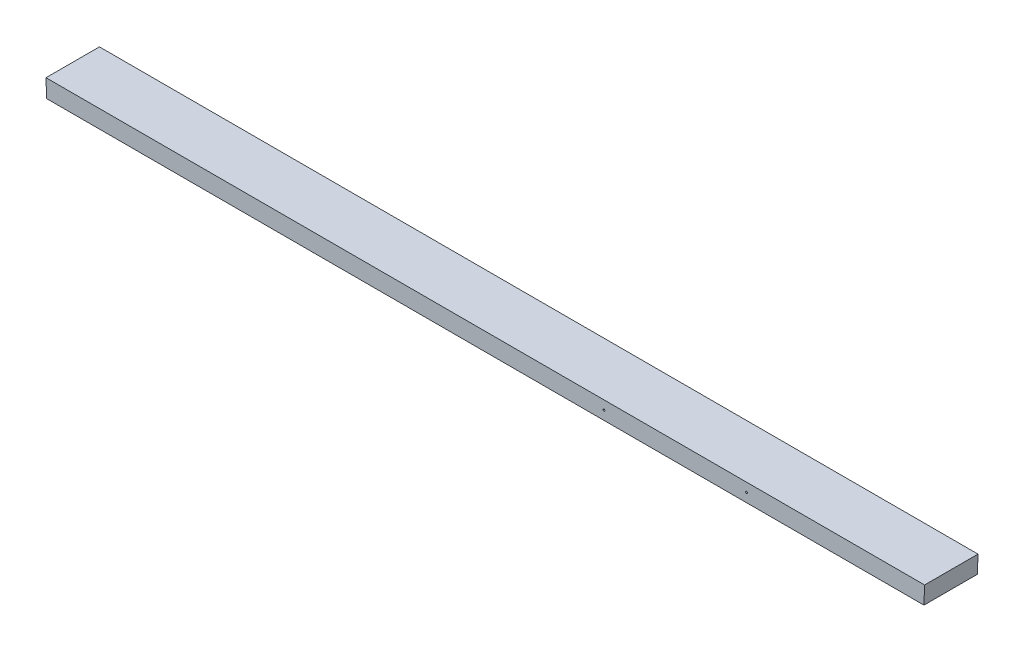
ISO-10303-21;
HEADER;
FILE_DESCRIPTION(('STEP AP214'),'2;1');
FILE_NAME('part.step','',(''),(''),'','','');
FILE_SCHEMA(('AUTOMOTIVE_DESIGN { 1 0 10303 214 1 1 1 1 }'));
ENDSEC;
DATA;
#1=APPLICATION_CONTEXT('core data for automotive mechanical design processes');
#2=APPLICATION_PROTOCOL_DEFINITION('international standard','automotive_design',2000,#1);
#3=PRODUCT_CONTEXT('',#1,'mechanical');
#4=PRODUCT('Part','Part','',(#3));
#5=PRODUCT_RELATED_PRODUCT_CATEGORY('part','',(#4));
#6=PRODUCT_DEFINITION_FORMATION('','',#4);
#7=PRODUCT_DEFINITION_CONTEXT('part definition',#1,'design');
#8=PRODUCT_DEFINITION('design','',#6,#7);
#9=PRODUCT_DEFINITION_SHAPE('','',#8);
#10=(LENGTH_UNIT() NAMED_UNIT(*) SI_UNIT(.MILLI.,.METRE.));
#11=(NAMED_UNIT(*) PLANE_ANGLE_UNIT() SI_UNIT($,.RADIAN.));
#12=(NAMED_UNIT(*) SI_UNIT($,.STERADIAN.) SOLID_ANGLE_UNIT());
#13=UNCERTAINTY_MEASURE_WITH_UNIT(LENGTH_MEASURE(1.E-05),#10,'distance_accuracy_value','');
#14=(GEOMETRIC_REPRESENTATION_CONTEXT(3) GLOBAL_UNCERTAINTY_ASSIGNED_CONTEXT((#13)) GLOBAL_UNIT_ASSIGNED_CONTEXT((#10,
#11,#12)) REPRESENTATION_CONTEXT('',''));
#15=CARTESIAN_POINT('',(0.,0.,0.));
#16=DIRECTION('',(0.,0.,1.));
#17=DIRECTION('',(1.,0.,0.));
#18=AXIS2_PLACEMENT_3D('',#15,#16,#17);
#19=CARTESIAN_POINT('',(-469.231738923998,5916.9300001442,2683.51));
#20=DIRECTION('',(0.,-1.,0.));
#21=DIRECTION('',(0.,0.,-1.));
#22=AXIS2_PLACEMENT_3D('',#19,#20,#21);
#23=PLANE('',#22);
#24=DIRECTION('',(1.,0.,0.));
#25=VECTOR('',#24,1.);
#26=CARTESIAN_POINT('',(-5.68434188608079E-13,5916.9300001442,2683.51));
#27=LINE('',#26,#25);
#28=CARTESIAN_POINT('',(-469.231738923998,5916.9300001442,2683.51));
#29=VERTEX_POINT('',#28);
#30=CARTESIAN_POINT('',(469.231738923998,5916.9300001442,2683.51));
#31=VERTEX_POINT('',#30);
#32=EDGE_CURVE('E156',#29,#31,#27,.T.);
#33=ORIENTED_EDGE('',*,*,#32,.T.);
#34=DIRECTION('',(0.,0.,1.));
#35=VECTOR('',#34,1.);
#36=CARTESIAN_POINT('',(469.231738923998,5916.9300001442,2683.51));
#37=LINE('',#36,#35);
#38=CARTESIAN_POINT('',(469.231738923998,5916.9300001442,2740.66));
#39=VERTEX_POINT('',#38);
#40=EDGE_CURVE('E78',#39,#31,#37,.F.);
#41=ORIENTED_EDGE('',*,*,#40,.F.);
#42=DIRECTION('',(-1.,0.,0.));
#43=VECTOR('',#42,1.);
#44=CARTESIAN_POINT('',(-5.68434188608079E-13,5916.9300001442,2740.66));
#45=LINE('',#44,#43);
#46=CARTESIAN_POINT('',(-469.231738923998,5916.9300001442,2740.66));
#47=VERTEX_POINT('',#46);
#48=EDGE_CURVE('E83',#39,#47,#45,.T.);
#49=ORIENTED_EDGE('',*,*,#48,.T.);
#50=DIRECTION('',(0.,0.,1.));
#51=VECTOR('',#50,1.);
#52=CARTESIAN_POINT('',(-469.231738923998,5916.9300001442,2683.51));
#53=LINE('',#52,#51);
#54=EDGE_CURVE('E149',#29,#47,#53,.T.);
#55=ORIENTED_EDGE('',*,*,#54,.F.);
#56=EDGE_LOOP('',(#33,#41,#49,#55));
#57=FACE_BOUND('',#56,.T.);
#58=ADVANCED_FACE('F37',(#57),#23,.T.);
#59=CARTESIAN_POINT('',(-5.68434188608079E-13,5926.4550001442,2740.66));
#60=DIRECTION('',(0.,0.,-1.));
#61=DIRECTION('',(-1.,0.,0.));
#62=AXIS2_PLACEMENT_3D('',#59,#60,#61);
#63=PLANE('',#62);
#64=CARTESIAN_POINT('',(127.000000000001,5926.4550001442,2740.66));
#65=DIRECTION('',(0.,0.,-1.));
#66=DIRECTION('',(-1.,0.,0.));
#67=AXIS2_PLACEMENT_3D('',#64,#65,#66);
#68=CIRCLE('',#67,0.991870000000006);
#69=CARTESIAN_POINT('',(126.008130000001,5926.4550001442,2740.66));
#70=VERTEX_POINT('',#69);
#71=EDGE_CURVE('E40',#70,#70,#68,.T.);
#72=ORIENTED_EDGE('',*,*,#71,.T.);
#73=EDGE_LOOP('',(#72));
#74=FACE_BOUND('',#73,.T.);
#75=CARTESIAN_POINT('',(279.400000000001,5926.4550001442,2740.66));
#76=DIRECTION('',(0.,0.,-1.));
#77=DIRECTION('',(-1.,0.,0.));
#78=AXIS2_PLACEMENT_3D('',#75,#76,#77);
#79=CIRCLE('',#78,0.991870000000006);
#80=CARTESIAN_POINT('',(278.408130000001,5926.4550001442,2740.66));
#81=VERTEX_POINT('',#80);
#82=EDGE_CURVE('E120',#81,#81,#79,.T.);
#83=ORIENTED_EDGE('',*,*,#82,.T.);
#84=EDGE_LOOP('',(#83));
#85=FACE_BOUND('',#84,.T.);
#86=ORIENTED_EDGE('',*,*,#48,.F.);
#87=DIRECTION('',(0.0340355254361646,0.999420623665674,0.));
#88=VECTOR('',#87,1.);
#89=CARTESIAN_POINT('',(469.231738923998,5916.9300001442,2740.66));
#90=LINE('',#89,#88);
#91=CARTESIAN_POINT('',(469.880491555479,5935.9800001442,2740.66));
#92=VERTEX_POINT('',#91);
#93=EDGE_CURVE('E161',#92,#39,#90,.F.);
#94=ORIENTED_EDGE('',*,*,#93,.F.);
#95=DIRECTION('',(1.,0.,0.));
#96=VECTOR('',#95,1.);
#97=CARTESIAN_POINT('',(469.880491555479,5935.9800001442,2740.66));
#98=LINE('',#97,#96);
#99=CARTESIAN_POINT('',(-469.880491555479,5935.9800001442,2740.66));
#100=VERTEX_POINT('',#99);
#101=EDGE_CURVE('E146',#100,#92,#98,.T.);
#102=ORIENTED_EDGE('',*,*,#101,.F.);
#103=DIRECTION('',(0.0340355254361644,-0.999420623665674,0.));
#104=VECTOR('',#103,1.);
#105=CARTESIAN_POINT('',(-469.880491555479,5935.9800001442,2740.66));
#106=LINE('',#105,#104);
#107=EDGE_CURVE('E153',#47,#100,#106,.F.);
#108=ORIENTED_EDGE('',*,*,#107,.F.);
#109=EDGE_LOOP('',(#86,#94,#102,#108));
#110=FACE_BOUND('',#109,.T.);
#111=ADVANCED_FACE('F176',(#74,#85,#110),#63,.F.);
#112=CARTESIAN_POINT('',(469.231738923998,5916.9300001442,2683.51));
#113=DIRECTION('',(0.999420623665674,-0.0340355254361646,0.));
#114=DIRECTION('',(0.0340355254361646,0.999420623665674,0.));
#115=AXIS2_PLACEMENT_3D('',#112,#113,#114);
#116=PLANE('',#115);
#117=DIRECTION('',(0.0340355254362027,0.999420623665672,0.));
#118=VECTOR('',#117,1.);
#119=CARTESIAN_POINT('',(469.231738923998,5916.9300001442,2683.51));
#120=LINE('',#119,#118);
#121=CARTESIAN_POINT('',(469.880491555478,5935.9800001442,2683.51));
#122=VERTEX_POINT('',#121);
#123=EDGE_CURVE('E158',#31,#122,#120,.T.);
#124=ORIENTED_EDGE('',*,*,#123,.T.);
#125=DIRECTION('',(0.,0.,1.));
#126=VECTOR('',#125,1.);
#127=CARTESIAN_POINT('',(469.880491555479,5935.9800001442,2683.51));
#128=LINE('',#127,#126);
#129=EDGE_CURVE('E143',#92,#122,#128,.F.);
#130=ORIENTED_EDGE('',*,*,#129,.F.);
#131=ORIENTED_EDGE('',*,*,#93,.T.);
#132=ORIENTED_EDGE('',*,*,#40,.T.);
#133=EDGE_LOOP('',(#124,#130,#131,#132));
#134=FACE_BOUND('',#133,.T.);
#135=ADVANCED_FACE('F214',(#134),#116,.T.);
#136=CARTESIAN_POINT('',(-5.68434188608079E-13,5565.14000007211,2683.51));
#137=DIRECTION('',(0.,0.,1.));
#138=DIRECTION('',(1.,0.,0.));
#139=AXIS2_PLACEMENT_3D('',#136,#137,#138);
#140=PLANE('',#139);
#141=CARTESIAN_POINT('',(0.,5926.4550001442,2683.51));
#142=DIRECTION('',(0.,0.,1.));
#143=DIRECTION('',(1.,0.,0.));
#144=AXIS2_PLACEMENT_3D('',#141,#142,#143);
#145=CIRCLE('',#144,0.991870000000001);
#146=CARTESIAN_POINT('',(0.991870000000001,5926.4550001442,2683.51));
#147=VERTEX_POINT('',#146);
#148=EDGE_CURVE('E124',#147,#147,#145,.T.);
#149=ORIENTED_EDGE('',*,*,#148,.T.);
#150=EDGE_LOOP('',(#149));
#151=FACE_BOUND('',#150,.T.);
#152=CARTESIAN_POINT('',(203.200000000001,5926.4550001442,2683.51));
#153=DIRECTION('',(0.,0.,1.));
#154=DIRECTION('',(1.,0.,0.));
#155=AXIS2_PLACEMENT_3D('',#152,#153,#154);
#156=CIRCLE('',#155,0.991870000000006);
#157=CARTESIAN_POINT('',(204.191870000001,5926.4550001442,2683.51));
#158=VERTEX_POINT('',#157);
#159=EDGE_CURVE('E128',#158,#158,#156,.T.);
#160=ORIENTED_EDGE('',*,*,#159,.T.);
#161=EDGE_LOOP('',(#160));
#162=FACE_BOUND('',#161,.T.);
#163=CARTESIAN_POINT('',(406.400000000001,5926.4550001442,2683.51));
#164=DIRECTION('',(0.,0.,1.));
#165=DIRECTION('',(1.,0.,0.));
#166=AXIS2_PLACEMENT_3D('',#163,#164,#165);
#167=CIRCLE('',#166,0.991870000000006);
#168=CARTESIAN_POINT('',(407.391870000001,5926.4550001442,2683.51));
#169=VERTEX_POINT('',#168);
#170=EDGE_CURVE('E132',#169,#169,#167,.T.);
#171=ORIENTED_EDGE('',*,*,#170,.T.);
#172=EDGE_LOOP('',(#171));
#173=FACE_BOUND('',#172,.T.);
#174=CARTESIAN_POINT('',(-406.4,5926.4550001442,2683.51));
#175=DIRECTION('',(0.,0.,1.));
#176=DIRECTION('',(1.,0.,0.));
#177=AXIS2_PLACEMENT_3D('',#174,#175,#176);
#178=CIRCLE('',#177,0.991870000000006);
#179=CARTESIAN_POINT('',(-405.40813,5926.4550001442,2683.51));
#180=VERTEX_POINT('',#179);
#181=EDGE_CURVE('E136',#180,#180,#178,.T.);
#182=ORIENTED_EDGE('',*,*,#181,.T.);
#183=EDGE_LOOP('',(#182));
#184=FACE_BOUND('',#183,.T.);
#185=CARTESIAN_POINT('',(-203.2,5926.4550001442,2683.51));
#186=DIRECTION('',(0.,0.,1.));
#187=DIRECTION('',(1.,0.,0.));
#188=AXIS2_PLACEMENT_3D('',#185,#186,#187);
#189=CIRCLE('',#188,0.991870000000006);
#190=CARTESIAN_POINT('',(-202.20813,5926.4550001442,2683.51));
#191=VERTEX_POINT('',#190);
#192=EDGE_CURVE('E139',#191,#191,#189,.T.);
#193=ORIENTED_EDGE('',*,*,#192,.T.);
#194=EDGE_LOOP('',(#193));
#195=FACE_BOUND('',#194,.T.);
#196=DIRECTION('',(0.0340355254361644,-0.999420623665674,0.));
#197=VECTOR('',#196,1.);
#198=CARTESIAN_POINT('',(-469.880491555479,5935.9800001442,2683.51));
#199=LINE('',#198,#197);
#200=CARTESIAN_POINT('',(-469.880491555479,5935.9800001442,2683.51));
#201=VERTEX_POINT('',#200);
#202=EDGE_CURVE('E55',#201,#29,#199,.T.);
#203=ORIENTED_EDGE('',*,*,#202,.F.);
#204=DIRECTION('',(1.,0.,0.));
#205=VECTOR('',#204,1.);
#206=CARTESIAN_POINT('',(469.880491555479,5935.9800001442,2683.51));
#207=LINE('',#206,#205);
#208=EDGE_CURVE('E46',#122,#201,#207,.F.);
#209=ORIENTED_EDGE('',*,*,#208,.F.);
#210=ORIENTED_EDGE('',*,*,#123,.F.);
#211=ORIENTED_EDGE('',*,*,#32,.F.);
#212=EDGE_LOOP('',(#203,#209,#210,#211));
#213=FACE_BOUND('',#212,.T.);
#214=ADVANCED_FACE('F207',(#151,#162,#173,#184,#195,#213),#140,.F.);
#215=CARTESIAN_POINT('',(-469.880491555479,5935.9800001442,2683.51));
#216=DIRECTION('',(-0.999420623665674,-0.0340355254361644,0.));
#217=DIRECTION('',(0.0340355254361644,-0.999420623665674,0.));
#218=AXIS2_PLACEMENT_3D('',#215,#216,#217);
#219=PLANE('',#218);
#220=ORIENTED_EDGE('',*,*,#202,.T.);
#221=ORIENTED_EDGE('',*,*,#54,.T.);
#222=ORIENTED_EDGE('',*,*,#107,.T.);
#223=DIRECTION('',(0.,0.,1.));
#224=VECTOR('',#223,1.);
#225=CARTESIAN_POINT('',(-469.880491555479,5935.9800001442,2683.51));
#226=LINE('',#225,#224);
#227=EDGE_CURVE('E11',#201,#100,#226,.T.);
#228=ORIENTED_EDGE('',*,*,#227,.F.);
#229=EDGE_LOOP('',(#220,#221,#222,#228));
#230=FACE_BOUND('',#229,.T.);
#231=ADVANCED_FACE('F197',(#230),#219,.T.);
#232=CARTESIAN_POINT('',(469.880491555479,5935.9800001442,2683.51));
#233=DIRECTION('',(0.,1.,0.));
#234=DIRECTION('',(0.,0.,1.));
#235=AXIS2_PLACEMENT_3D('',#232,#233,#234);
#236=PLANE('',#235);
#237=ORIENTED_EDGE('',*,*,#208,.T.);
#238=ORIENTED_EDGE('',*,*,#227,.T.);
#239=ORIENTED_EDGE('',*,*,#101,.T.);
#240=ORIENTED_EDGE('',*,*,#129,.T.);
#241=EDGE_LOOP('',(#237,#238,#239,#240));
#242=FACE_BOUND('',#241,.T.);
#243=ADVANCED_FACE('F194',(#242),#236,.T.);
#244=CARTESIAN_POINT('',(-203.2,5926.4550001442,2664.46));
#245=DIRECTION('',(0.,0.,-1.));
#246=DIRECTION('',(-1.,0.,0.));
#247=AXIS2_PLACEMENT_3D('',#244,#245,#246);
#248=CYLINDRICAL_SURFACE('',#247,0.991870000000006);
#249=CARTESIAN_POINT('',(-203.2,5926.4550001442,2696.21));
#250=DIRECTION('',(0.,0.,-1.));
#251=DIRECTION('',(-1.,0.,0.));
#252=AXIS2_PLACEMENT_3D('',#249,#250,#251);
#253=CIRCLE('',#252,0.991870000000006);
#254=CARTESIAN_POINT('',(-204.19187,5926.4550001442,2696.21));
#255=VERTEX_POINT('',#254);
#256=EDGE_CURVE('E137',#255,#255,#253,.T.);
#257=ORIENTED_EDGE('',*,*,#256,.F.);
#258=EDGE_LOOP('',(#257));
#259=FACE_BOUND('',#258,.T.);
#260=ORIENTED_EDGE('',*,*,#192,.F.);
#261=EDGE_LOOP('',(#260));
#262=FACE_BOUND('',#261,.T.);
#263=ADVANCED_FACE('F196',(#259,#262),#248,.F.);
#264=CARTESIAN_POINT('',(-203.2,5926.4550001442,2696.21));
#265=DIRECTION('',(0.,0.,-1.));
#266=DIRECTION('',(-1.,0.,0.));
#267=AXIS2_PLACEMENT_3D('',#264,#265,#266);
#268=CONICAL_SURFACE('',#267,0.991870000000006,1.02974425867677);
#269=CARTESIAN_POINT('',(-203.2,5926.4550001442,2696.8059756222));
#270=VERTEX_POINT('',#269);
#271=VERTEX_LOOP('',#270);
#272=FACE_BOUND('',#271,.T.);
#273=ORIENTED_EDGE('',*,*,#256,.T.);
#274=EDGE_LOOP('',(#273));
#275=FACE_BOUND('',#274,.T.);
#276=ADVANCED_FACE('F204',(#272,#275),#268,.F.);
#277=CARTESIAN_POINT('',(-406.4,5926.4550001442,2664.46));
#278=DIRECTION('',(0.,0.,-1.));
#279=DIRECTION('',(-1.,0.,0.));
#280=AXIS2_PLACEMENT_3D('',#277,#278,#279);
#281=CYLINDRICAL_SURFACE('',#280,0.991870000000006);
#282=CARTESIAN_POINT('',(-406.4,5926.4550001442,2696.21));
#283=DIRECTION('',(0.,0.,-1.));
#284=DIRECTION('',(-1.,0.,0.));
#285=AXIS2_PLACEMENT_3D('',#282,#283,#284);
#286=CIRCLE('',#285,0.991870000000006);
#287=CARTESIAN_POINT('',(-407.39187,5926.4550001442,2696.21));
#288=VERTEX_POINT('',#287);
#289=EDGE_CURVE('E133',#288,#288,#286,.T.);
#290=ORIENTED_EDGE('',*,*,#289,.F.);
#291=EDGE_LOOP('',(#290));
#292=FACE_BOUND('',#291,.T.);
#293=ORIENTED_EDGE('',*,*,#181,.F.);
#294=EDGE_LOOP('',(#293));
#295=FACE_BOUND('',#294,.T.);
#296=ADVANCED_FACE('F305',(#292,#295),#281,.F.);
#297=CARTESIAN_POINT('',(-406.4,5926.4550001442,2696.21));
#298=DIRECTION('',(0.,0.,-1.));
#299=DIRECTION('',(-1.,0.,0.));
#300=AXIS2_PLACEMENT_3D('',#297,#298,#299);
#301=CONICAL_SURFACE('',#300,0.991870000000006,1.02974425867677);
#302=CARTESIAN_POINT('',(-406.4,5926.4550001442,2696.8059756222));
#303=VERTEX_POINT('',#302);
#304=VERTEX_LOOP('',#303);
#305=FACE_BOUND('',#304,.T.);
#306=ORIENTED_EDGE('',*,*,#289,.T.);
#307=EDGE_LOOP('',(#306));
#308=FACE_BOUND('',#307,.T.);
#309=ADVANCED_FACE('F296',(#305,#308),#301,.F.);
#310=CARTESIAN_POINT('',(406.400000000001,5926.4550001442,2664.46));
#311=DIRECTION('',(0.,0.,-1.));
#312=DIRECTION('',(-1.,0.,0.));
#313=AXIS2_PLACEMENT_3D('',#310,#311,#312);
#314=CYLINDRICAL_SURFACE('',#313,0.991870000000006);
#315=CARTESIAN_POINT('',(406.400000000001,5926.4550001442,2696.21));
#316=DIRECTION('',(0.,0.,-1.));
#317=DIRECTION('',(-1.,0.,0.));
#318=AXIS2_PLACEMENT_3D('',#315,#316,#317);
#319=CIRCLE('',#318,0.991870000000006);
#320=CARTESIAN_POINT('',(405.408130000001,5926.4550001442,2696.21));
#321=VERTEX_POINT('',#320);
#322=EDGE_CURVE('E129',#321,#321,#319,.T.);
#323=ORIENTED_EDGE('',*,*,#322,.F.);
#324=EDGE_LOOP('',(#323));
#325=FACE_BOUND('',#324,.T.);
#326=ORIENTED_EDGE('',*,*,#170,.F.);
#327=EDGE_LOOP('',(#326));
#328=FACE_BOUND('',#327,.T.);
#329=ADVANCED_FACE('F287',(#325,#328),#314,.F.);
#330=CARTESIAN_POINT('',(406.400000000001,5926.4550001442,2696.21));
#331=DIRECTION('',(0.,0.,-1.));
#332=DIRECTION('',(-1.,0.,0.));
#333=AXIS2_PLACEMENT_3D('',#330,#331,#332);
#334=CONICAL_SURFACE('',#333,0.991870000000006,1.02974425867677);
#335=CARTESIAN_POINT('',(406.400000000001,5926.4550001442,2696.8059756222));
#336=VERTEX_POINT('',#335);
#337=VERTEX_LOOP('',#336);
#338=FACE_BOUND('',#337,.T.);
#339=ORIENTED_EDGE('',*,*,#322,.T.);
#340=EDGE_LOOP('',(#339));
#341=FACE_BOUND('',#340,.T.);
#342=ADVANCED_FACE('F278',(#338,#341),#334,.F.);
#343=CARTESIAN_POINT('',(203.200000000001,5926.4550001442,2664.46));
#344=DIRECTION('',(0.,0.,-1.));
#345=DIRECTION('',(-1.,0.,0.));
#346=AXIS2_PLACEMENT_3D('',#343,#344,#345);
#347=CYLINDRICAL_SURFACE('',#346,0.991870000000006);
#348=CARTESIAN_POINT('',(203.200000000001,5926.4550001442,2696.21));
#349=DIRECTION('',(0.,0.,-1.));
#350=DIRECTION('',(-1.,0.,0.));
#351=AXIS2_PLACEMENT_3D('',#348,#349,#350);
#352=CIRCLE('',#351,0.991870000000006);
#353=CARTESIAN_POINT('',(202.208130000001,5926.4550001442,2696.21));
#354=VERTEX_POINT('',#353);
#355=EDGE_CURVE('E125',#354,#354,#352,.T.);
#356=ORIENTED_EDGE('',*,*,#355,.F.);
#357=EDGE_LOOP('',(#356));
#358=FACE_BOUND('',#357,.T.);
#359=ORIENTED_EDGE('',*,*,#159,.F.);
#360=EDGE_LOOP('',(#359));
#361=FACE_BOUND('',#360,.T.);
#362=ADVANCED_FACE('F269',(#358,#361),#347,.F.);
#363=CARTESIAN_POINT('',(203.200000000001,5926.4550001442,2696.21));
#364=DIRECTION('',(0.,0.,-1.));
#365=DIRECTION('',(-1.,0.,0.));
#366=AXIS2_PLACEMENT_3D('',#363,#364,#365);
#367=CONICAL_SURFACE('',#366,0.991870000000006,1.02974425867677);
#368=CARTESIAN_POINT('',(203.200000000001,5926.4550001442,2696.8059756222));
#369=VERTEX_POINT('',#368);
#370=VERTEX_LOOP('',#369);
#371=FACE_BOUND('',#370,.T.);
#372=ORIENTED_EDGE('',*,*,#355,.T.);
#373=EDGE_LOOP('',(#372));
#374=FACE_BOUND('',#373,.T.);
#375=ADVANCED_FACE('F260',(#371,#374),#367,.F.);
#376=CARTESIAN_POINT('',(0.,5926.4550001442,2664.46));
#377=DIRECTION('',(0.,0.,-1.));
#378=DIRECTION('',(-1.,0.,0.));
#379=AXIS2_PLACEMENT_3D('',#376,#377,#378);
#380=CYLINDRICAL_SURFACE('',#379,0.991870000000001);
#381=CARTESIAN_POINT('',(0.,5926.4550001442,2696.21));
#382=DIRECTION('',(0.,0.,-1.));
#383=DIRECTION('',(-1.,0.,0.));
#384=AXIS2_PLACEMENT_3D('',#381,#382,#383);
#385=CIRCLE('',#384,0.99187);
#386=CARTESIAN_POINT('',(-0.99187,5926.4550001442,2696.21));
#387=VERTEX_POINT('',#386);
#388=EDGE_CURVE('E121',#387,#387,#385,.T.);
#389=ORIENTED_EDGE('',*,*,#388,.F.);
#390=EDGE_LOOP('',(#389));
#391=FACE_BOUND('',#390,.T.);
#392=ORIENTED_EDGE('',*,*,#148,.F.);
#393=EDGE_LOOP('',(#392));
#394=FACE_BOUND('',#393,.T.);
#395=ADVANCED_FACE('F190',(#391,#394),#380,.F.);
#396=CARTESIAN_POINT('',(0.,5926.4550001442,2696.21));
#397=DIRECTION('',(0.,0.,-1.));
#398=DIRECTION('',(-1.,0.,0.));
#399=AXIS2_PLACEMENT_3D('',#396,#397,#398);
#400=CONICAL_SURFACE('',#399,0.99187,1.02974425867677);
#401=CARTESIAN_POINT('',(0.,5926.4550001442,2696.8059756222));
#402=VERTEX_POINT('',#401);
#403=VERTEX_LOOP('',#402);
#404=FACE_BOUND('',#403,.T.);
#405=ORIENTED_EDGE('',*,*,#388,.T.);
#406=EDGE_LOOP('',(#405));
#407=FACE_BOUND('',#406,.T.);
#408=ADVANCED_FACE('F181',(#404,#407),#400,.F.);
#409=CARTESIAN_POINT('',(279.400000000001,5926.4550001442,2759.71000000001));
#410=DIRECTION('',(0.,0.,1.));
#411=DIRECTION('',(1.,0.,0.));
#412=AXIS2_PLACEMENT_3D('',#409,#410,#411);
#413=CYLINDRICAL_SURFACE('',#412,0.991870000000006);
#414=CARTESIAN_POINT('',(279.400000000001,5926.4550001442,2721.61000000001));
#415=DIRECTION('',(0.,0.,1.));
#416=DIRECTION('',(1.,0.,0.));
#417=AXIS2_PLACEMENT_3D('',#414,#415,#416);
#418=CIRCLE('',#417,0.991870000000006);
#419=CARTESIAN_POINT('',(280.391870000001,5926.4550001442,2721.61000000001));
#420=VERTEX_POINT('',#419);
#421=EDGE_CURVE('E116',#420,#420,#418,.T.);
#422=ORIENTED_EDGE('',*,*,#421,.F.);
#423=EDGE_LOOP('',(#422));
#424=FACE_BOUND('',#423,.T.);
#425=ORIENTED_EDGE('',*,*,#82,.F.);
#426=EDGE_LOOP('',(#425));
#427=FACE_BOUND('',#426,.T.);
#428=ADVANCED_FACE('F178',(#424,#427),#413,.F.);
#429=CARTESIAN_POINT('',(279.400000000001,5926.4550001442,2721.61000000001));
#430=DIRECTION('',(0.,0.,1.));
#431=DIRECTION('',(1.,0.,0.));
#432=AXIS2_PLACEMENT_3D('',#429,#430,#431);
#433=CONICAL_SURFACE('',#432,0.991870000000006,1.02974425867677);
#434=CARTESIAN_POINT('',(279.400000000001,5926.4550001442,2721.01402437781));
#435=VERTEX_POINT('',#434);
#436=VERTEX_LOOP('',#435);
#437=FACE_BOUND('',#436,.T.);
#438=ORIENTED_EDGE('',*,*,#421,.T.);
#439=EDGE_LOOP('',(#438));
#440=FACE_BOUND('',#439,.T.);
#441=ADVANCED_FACE('F180',(#437,#440),#433,.F.);
#442=CARTESIAN_POINT('',(127.000000000001,5926.4550001442,2759.71000000001));
#443=DIRECTION('',(0.,0.,1.));
#444=DIRECTION('',(1.,0.,0.));
#445=AXIS2_PLACEMENT_3D('',#442,#443,#444);
#446=CYLINDRICAL_SURFACE('',#445,0.991870000000006);
#447=CARTESIAN_POINT('',(127.000000000001,5926.4550001442,2721.61000000001));
#448=DIRECTION('',(0.,0.,1.));
#449=DIRECTION('',(1.,0.,0.));
#450=AXIS2_PLACEMENT_3D('',#447,#448,#449);
#451=CIRCLE('',#450,0.991870000000006);
#452=CARTESIAN_POINT('',(127.991870000001,5926.4550001442,2721.61000000001));
#453=VERTEX_POINT('',#452);
#454=EDGE_CURVE('E112',#453,#453,#451,.T.);
#455=ORIENTED_EDGE('',*,*,#454,.F.);
#456=EDGE_LOOP('',(#455));
#457=FACE_BOUND('',#456,.T.);
#458=ORIENTED_EDGE('',*,*,#71,.F.);
#459=EDGE_LOOP('',(#458));
#460=FACE_BOUND('',#459,.T.);
#461=ADVANCED_FACE('F108',(#457,#460),#446,.F.);
#462=CARTESIAN_POINT('',(127.000000000001,5926.4550001442,2721.61000000001));
#463=DIRECTION('',(0.,0.,1.));
#464=DIRECTION('',(1.,0.,0.));
#465=AXIS2_PLACEMENT_3D('',#462,#463,#464);
#466=CONICAL_SURFACE('',#465,0.991870000000006,1.02974425867677);
#467=CARTESIAN_POINT('',(127.000000000001,5926.4550001442,2721.01402437781));
#468=VERTEX_POINT('',#467);
#469=VERTEX_LOOP('',#468);
#470=FACE_BOUND('',#469,.T.);
#471=ORIENTED_EDGE('',*,*,#454,.T.);
#472=EDGE_LOOP('',(#471));
#473=FACE_BOUND('',#472,.T.);
#474=ADVANCED_FACE('F105',(#470,#473),#466,.F.);
#475=CLOSED_SHELL('',(#58,#111,#135,#214,#231,#243,#263,#276,#296,#309,#329,#342,#362,#375,#395,
#408,#428,#441,#461,#474));
#476=MANIFOLD_SOLID_BREP('B2',#475);
#477=ADVANCED_BREP_SHAPE_REPRESENTATION('',(#18,#476),#14);
#478=SHAPE_DEFINITION_REPRESENTATION(#9,#477);
ENDSEC;
END-ISO-10303-21;
